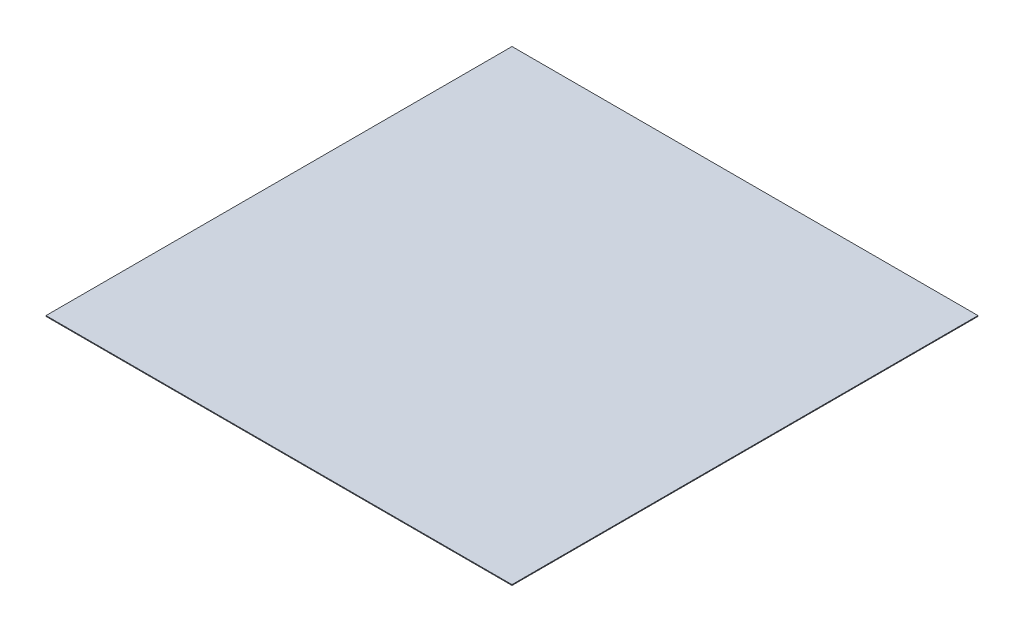
ISO-10303-21;
HEADER;
FILE_DESCRIPTION(('STEP AP214'),'2;1');
FILE_NAME('part.step','',(''),(''),'','','');
FILE_SCHEMA(('AUTOMOTIVE_DESIGN { 1 0 10303 214 1 1 1 1 }'));
ENDSEC;
DATA;
#1=APPLICATION_CONTEXT('core data for automotive mechanical design processes');
#2=APPLICATION_PROTOCOL_DEFINITION('international standard','automotive_design',2000,#1);
#3=PRODUCT_CONTEXT('',#1,'mechanical');
#4=PRODUCT('Part','Part','',(#3));
#5=PRODUCT_RELATED_PRODUCT_CATEGORY('part','',(#4));
#6=PRODUCT_DEFINITION_FORMATION('','',#4);
#7=PRODUCT_DEFINITION_CONTEXT('part definition',#1,'design');
#8=PRODUCT_DEFINITION('design','',#6,#7);
#9=PRODUCT_DEFINITION_SHAPE('','',#8);
#10=(LENGTH_UNIT() NAMED_UNIT(*) SI_UNIT(.MILLI.,.METRE.));
#11=(NAMED_UNIT(*) PLANE_ANGLE_UNIT() SI_UNIT($,.RADIAN.));
#12=(NAMED_UNIT(*) SI_UNIT($,.STERADIAN.) SOLID_ANGLE_UNIT());
#13=UNCERTAINTY_MEASURE_WITH_UNIT(LENGTH_MEASURE(1.E-05),#10,'distance_accuracy_value','');
#14=(GEOMETRIC_REPRESENTATION_CONTEXT(3) GLOBAL_UNCERTAINTY_ASSIGNED_CONTEXT((#13)) GLOBAL_UNIT_ASSIGNED_CONTEXT((#10,
#11,#12)) REPRESENTATION_CONTEXT('',''));
#15=CARTESIAN_POINT('',(0.,0.,0.));
#16=DIRECTION('',(0.,0.,1.));
#17=DIRECTION('',(1.,0.,0.));
#18=AXIS2_PLACEMENT_3D('',#15,#16,#17);
#19=CARTESIAN_POINT('',(381.,1.27,-381.));
#20=DIRECTION('',(-1.,0.,0.));
#21=DIRECTION('',(0.,0.,1.));
#22=AXIS2_PLACEMENT_3D('',#19,#20,#21);
#23=PLANE('',#22);
#24=DIRECTION('',(0.,0.,-1.));
#25=VECTOR('',#24,1.);
#26=CARTESIAN_POINT('',(381.,0.,-381.));
#27=LINE('',#26,#25);
#28=CARTESIAN_POINT('',(381.,0.,381.));
#29=VERTEX_POINT('',#28);
#30=CARTESIAN_POINT('',(381.,0.,-381.));
#31=VERTEX_POINT('',#30);
#32=EDGE_CURVE('E94',#29,#31,#27,.T.);
#33=ORIENTED_EDGE('',*,*,#32,.T.);
#34=DIRECTION('',(0.,-1.,0.));
#35=VECTOR('',#34,1.);
#36=CARTESIAN_POINT('',(381.,1.27,-381.));
#37=LINE('',#36,#35);
#38=CARTESIAN_POINT('',(381.,1.27,-381.));
#39=VERTEX_POINT('',#38);
#40=EDGE_CURVE('E11',#39,#31,#37,.T.);
#41=ORIENTED_EDGE('',*,*,#40,.F.);
#42=DIRECTION('',(0.,0.,-1.));
#43=VECTOR('',#42,1.);
#44=CARTESIAN_POINT('',(381.,1.27,-381.));
#45=LINE('',#44,#43);
#46=CARTESIAN_POINT('',(381.,1.27,381.));
#47=VERTEX_POINT('',#46);
#48=EDGE_CURVE('E82',#47,#39,#45,.T.);
#49=ORIENTED_EDGE('',*,*,#48,.F.);
#50=DIRECTION('',(0.,-1.,0.));
#51=VECTOR('',#50,1.);
#52=CARTESIAN_POINT('',(381.,1.27,381.));
#53=LINE('',#52,#51);
#54=EDGE_CURVE('E90',#47,#29,#53,.T.);
#55=ORIENTED_EDGE('',*,*,#54,.T.);
#56=EDGE_LOOP('',(#33,#41,#49,#55));
#57=FACE_BOUND('',#56,.T.);
#58=ADVANCED_FACE('F31',(#57),#23,.F.);
#59=CARTESIAN_POINT('',(-381.,1.27,-381.));
#60=DIRECTION('',(0.,0.,1.));
#61=DIRECTION('',(1.,0.,0.));
#62=AXIS2_PLACEMENT_3D('',#59,#60,#61);
#63=PLANE('',#62);
#64=DIRECTION('',(-1.,0.,0.));
#65=VECTOR('',#64,1.);
#66=CARTESIAN_POINT('',(-381.,0.,-381.));
#67=LINE('',#66,#65);
#68=CARTESIAN_POINT('',(-381.,0.,-381.));
#69=VERTEX_POINT('',#68);
#70=EDGE_CURVE('E86',#31,#69,#67,.T.);
#71=ORIENTED_EDGE('',*,*,#70,.T.);
#72=DIRECTION('',(0.,-1.,0.));
#73=VECTOR('',#72,1.);
#74=CARTESIAN_POINT('',(-381.,1.27,-381.));
#75=LINE('',#74,#73);
#76=CARTESIAN_POINT('',(-381.,1.27,-381.));
#77=VERTEX_POINT('',#76);
#78=EDGE_CURVE('E39',#77,#69,#75,.T.);
#79=ORIENTED_EDGE('',*,*,#78,.F.);
#80=DIRECTION('',(-1.,0.,0.));
#81=VECTOR('',#80,1.);
#82=CARTESIAN_POINT('',(-381.,1.27,-381.));
#83=LINE('',#82,#81);
#84=EDGE_CURVE('E77',#39,#77,#83,.T.);
#85=ORIENTED_EDGE('',*,*,#84,.F.);
#86=ORIENTED_EDGE('',*,*,#40,.T.);
#87=EDGE_LOOP('',(#71,#79,#85,#86));
#88=FACE_BOUND('',#87,.T.);
#89=ADVANCED_FACE('F85',(#88),#63,.F.);
#90=CARTESIAN_POINT('',(-381.,1.27,-381.));
#91=DIRECTION('',(1.,0.,0.));
#92=DIRECTION('',(0.,0.,-1.));
#93=AXIS2_PLACEMENT_3D('',#90,#91,#92);
#94=PLANE('',#93);
#95=DIRECTION('',(0.,0.,1.));
#96=VECTOR('',#95,1.);
#97=CARTESIAN_POINT('',(-381.,0.,-381.));
#98=LINE('',#97,#96);
#99=CARTESIAN_POINT('',(-381.,0.,381.));
#100=VERTEX_POINT('',#99);
#101=EDGE_CURVE('E64',#69,#100,#98,.T.);
#102=ORIENTED_EDGE('',*,*,#101,.T.);
#103=DIRECTION('',(0.,-1.,0.));
#104=VECTOR('',#103,1.);
#105=CARTESIAN_POINT('',(-381.,1.27,381.));
#106=LINE('',#105,#104);
#107=CARTESIAN_POINT('',(-381.,1.27,381.));
#108=VERTEX_POINT('',#107);
#109=EDGE_CURVE('E87',#108,#100,#106,.T.);
#110=ORIENTED_EDGE('',*,*,#109,.F.);
#111=DIRECTION('',(0.,0.,1.));
#112=VECTOR('',#111,1.);
#113=CARTESIAN_POINT('',(-381.,1.27,-381.));
#114=LINE('',#113,#112);
#115=EDGE_CURVE('E80',#77,#108,#114,.T.);
#116=ORIENTED_EDGE('',*,*,#115,.F.);
#117=ORIENTED_EDGE('',*,*,#78,.T.);
#118=EDGE_LOOP('',(#102,#110,#116,#117));
#119=FACE_BOUND('',#118,.T.);
#120=ADVANCED_FACE('F88',(#119),#94,.F.);
#121=CARTESIAN_POINT('',(-381.,1.27,381.));
#122=DIRECTION('',(0.,0.,-1.));
#123=DIRECTION('',(-1.,0.,0.));
#124=AXIS2_PLACEMENT_3D('',#121,#122,#123);
#125=PLANE('',#124);
#126=DIRECTION('',(1.,0.,0.));
#127=VECTOR('',#126,1.);
#128=CARTESIAN_POINT('',(-381.,0.,381.));
#129=LINE('',#128,#127);
#130=EDGE_CURVE('E70',#100,#29,#129,.T.);
#131=ORIENTED_EDGE('',*,*,#130,.T.);
#132=ORIENTED_EDGE('',*,*,#54,.F.);
#133=DIRECTION('',(1.,0.,0.));
#134=VECTOR('',#133,1.);
#135=CARTESIAN_POINT('',(-381.,1.27,381.));
#136=LINE('',#135,#134);
#137=EDGE_CURVE('E47',#108,#47,#136,.T.);
#138=ORIENTED_EDGE('',*,*,#137,.F.);
#139=ORIENTED_EDGE('',*,*,#109,.T.);
#140=EDGE_LOOP('',(#131,#132,#138,#139));
#141=FACE_BOUND('',#140,.T.);
#142=ADVANCED_FACE('F101',(#141),#125,.F.);
#143=CARTESIAN_POINT('',(381.,1.27,381.));
#144=DIRECTION('',(0.,1.,0.));
#145=DIRECTION('',(0.,0.,1.));
#146=AXIS2_PLACEMENT_3D('',#143,#144,#145);
#147=PLANE('',#146);
#148=ORIENTED_EDGE('',*,*,#48,.T.);
#149=ORIENTED_EDGE('',*,*,#84,.T.);
#150=ORIENTED_EDGE('',*,*,#115,.T.);
#151=ORIENTED_EDGE('',*,*,#137,.T.);
#152=EDGE_LOOP('',(#148,#149,#150,#151));
#153=FACE_BOUND('',#152,.T.);
#154=ADVANCED_FACE('F78',(#153),#147,.T.);
#155=CARTESIAN_POINT('',(381.,0.,381.));
#156=DIRECTION('',(0.,1.,0.));
#157=DIRECTION('',(0.,0.,1.));
#158=AXIS2_PLACEMENT_3D('',#155,#156,#157);
#159=PLANE('',#158);
#160=ORIENTED_EDGE('',*,*,#32,.F.);
#161=ORIENTED_EDGE('',*,*,#130,.F.);
#162=ORIENTED_EDGE('',*,*,#101,.F.);
#163=ORIENTED_EDGE('',*,*,#70,.F.);
#164=EDGE_LOOP('',(#160,#161,#162,#163));
#165=FACE_BOUND('',#164,.T.);
#166=ADVANCED_FACE('F104',(#165),#159,.F.);
#167=CLOSED_SHELL('',(#58,#89,#120,#142,#154,#166));
#168=MANIFOLD_SOLID_BREP('B2',#167);
#169=ADVANCED_BREP_SHAPE_REPRESENTATION('',(#18,#168),#14);
#170=SHAPE_DEFINITION_REPRESENTATION(#9,#169);
ENDSEC;
END-ISO-10303-21;
